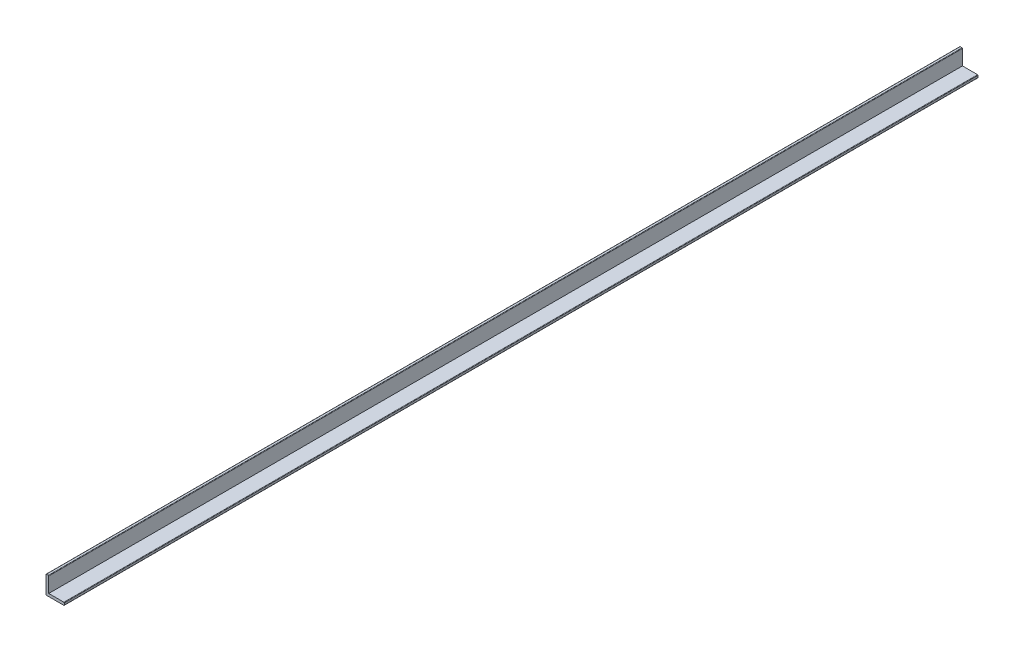
ISO-10303-21;
HEADER;
FILE_DESCRIPTION(('STEP AP214'),'2;1');
FILE_NAME('part.step','',(''),(''),'','','');
FILE_SCHEMA(('AUTOMOTIVE_DESIGN { 1 0 10303 214 1 1 1 1 }'));
ENDSEC;
DATA;
#1=APPLICATION_CONTEXT('core data for automotive mechanical design processes');
#2=APPLICATION_PROTOCOL_DEFINITION('international standard','automotive_design',2000,#1);
#3=PRODUCT_CONTEXT('',#1,'mechanical');
#4=PRODUCT('Part','Part','',(#3));
#5=PRODUCT_RELATED_PRODUCT_CATEGORY('part','',(#4));
#6=PRODUCT_DEFINITION_FORMATION('','',#4);
#7=PRODUCT_DEFINITION_CONTEXT('part definition',#1,'design');
#8=PRODUCT_DEFINITION('design','',#6,#7);
#9=PRODUCT_DEFINITION_SHAPE('','',#8);
#10=(LENGTH_UNIT() NAMED_UNIT(*) SI_UNIT(.MILLI.,.METRE.));
#11=(NAMED_UNIT(*) PLANE_ANGLE_UNIT() SI_UNIT($,.RADIAN.));
#12=(NAMED_UNIT(*) SI_UNIT($,.STERADIAN.) SOLID_ANGLE_UNIT());
#13=UNCERTAINTY_MEASURE_WITH_UNIT(LENGTH_MEASURE(1.E-05),#10,'distance_accuracy_value','');
#14=(GEOMETRIC_REPRESENTATION_CONTEXT(3) GLOBAL_UNCERTAINTY_ASSIGNED_CONTEXT((#13)) GLOBAL_UNIT_ASSIGNED_CONTEXT((#10,
#11,#12)) REPRESENTATION_CONTEXT('',''));
#15=CARTESIAN_POINT('',(0.,0.,0.));
#16=DIRECTION('',(0.,0.,1.));
#17=DIRECTION('',(1.,0.,0.));
#18=AXIS2_PLACEMENT_3D('',#15,#16,#17);
#19=CARTESIAN_POINT('',(0.,0.,1000.));
#20=DIRECTION('',(0.,1.,0.));
#21=DIRECTION('',(0.,0.,1.));
#22=AXIS2_PLACEMENT_3D('',#19,#20,#21);
#23=PLANE('',#22);
#24=DIRECTION('',(1.,0.,0.));
#25=VECTOR('',#24,1.);
#26=CARTESIAN_POINT('',(0.,0.,0.));
#27=LINE('',#26,#25);
#28=CARTESIAN_POINT('',(0.5,0.,0.));
#29=VERTEX_POINT('',#28);
#30=CARTESIAN_POINT('',(19.5,0.,0.));
#31=VERTEX_POINT('',#30);
#32=EDGE_CURVE('E136',#29,#31,#27,.T.);
#33=ORIENTED_EDGE('',*,*,#32,.T.);
#34=DIRECTION('',(0.,0.,-1.));
#35=VECTOR('',#34,1.);
#36=CARTESIAN_POINT('',(19.5,0.,1000.));
#37=LINE('',#36,#35);
#38=CARTESIAN_POINT('',(19.5,0.,1000.));
#39=VERTEX_POINT('',#38);
#40=EDGE_CURVE('E167',#31,#39,#37,.F.);
#41=ORIENTED_EDGE('',*,*,#40,.T.);
#42=DIRECTION('',(1.,0.,0.));
#43=VECTOR('',#42,1.);
#44=CARTESIAN_POINT('',(0.,0.,1000.));
#45=LINE('',#44,#43);
#46=CARTESIAN_POINT('',(0.5,0.,1000.));
#47=VERTEX_POINT('',#46);
#48=EDGE_CURVE('E129',#47,#39,#45,.T.);
#49=ORIENTED_EDGE('',*,*,#48,.F.);
#50=DIRECTION('',(0.,0.,-1.));
#51=VECTOR('',#50,1.);
#52=CARTESIAN_POINT('',(0.5,0.,1000.));
#53=LINE('',#52,#51);
#54=EDGE_CURVE('E164',#47,#29,#53,.T.);
#55=ORIENTED_EDGE('',*,*,#54,.T.);
#56=EDGE_LOOP('',(#33,#41,#49,#55));
#57=FACE_BOUND('',#56,.T.);
#58=ADVANCED_FACE('F15',(#57),#23,.F.);
#59=CARTESIAN_POINT('',(20.,3.,1000.));
#60=DIRECTION('',(1.,0.,0.));
#61=DIRECTION('',(0.,0.,-1.));
#62=AXIS2_PLACEMENT_3D('',#59,#60,#61);
#63=PLANE('',#62);
#64=DIRECTION('',(0.,-1.,0.));
#65=VECTOR('',#64,1.);
#66=CARTESIAN_POINT('',(20.,3.,1000.));
#67=LINE('',#66,#65);
#68=CARTESIAN_POINT('',(20.,2.5,1000.));
#69=VERTEX_POINT('',#68);
#70=CARTESIAN_POINT('',(20.,0.5,1000.));
#71=VERTEX_POINT('',#70);
#72=EDGE_CURVE('E126',#69,#71,#67,.T.);
#73=ORIENTED_EDGE('',*,*,#72,.T.);
#74=DIRECTION('',(0.,0.,-1.));
#75=VECTOR('',#74,1.);
#76=CARTESIAN_POINT('',(20.,0.5,0.));
#77=LINE('',#76,#75);
#78=CARTESIAN_POINT('',(20.,0.5,0.));
#79=VERTEX_POINT('',#78);
#80=EDGE_CURVE('E151',#71,#79,#77,.T.);
#81=ORIENTED_EDGE('',*,*,#80,.T.);
#82=DIRECTION('',(0.,-1.,0.));
#83=VECTOR('',#82,1.);
#84=CARTESIAN_POINT('',(20.,3.,0.));
#85=LINE('',#84,#83);
#86=CARTESIAN_POINT('',(20.,2.5,0.));
#87=VERTEX_POINT('',#86);
#88=EDGE_CURVE('E139',#87,#79,#85,.T.);
#89=ORIENTED_EDGE('',*,*,#88,.F.);
#90=DIRECTION('',(0.,0.,-1.));
#91=VECTOR('',#90,1.);
#92=CARTESIAN_POINT('',(20.,2.5,1000.));
#93=LINE('',#92,#91);
#94=EDGE_CURVE('E118',#87,#69,#93,.F.);
#95=ORIENTED_EDGE('',*,*,#94,.T.);
#96=EDGE_LOOP('',(#73,#81,#89,#95));
#97=FACE_BOUND('',#96,.T.);
#98=ADVANCED_FACE('F211',(#97),#63,.T.);
#99=CARTESIAN_POINT('',(0.,3.,1000.));
#100=DIRECTION('',(0.,1.,0.));
#101=DIRECTION('',(0.,0.,1.));
#102=AXIS2_PLACEMENT_3D('',#99,#100,#101);
#103=PLANE('',#102);
#104=DIRECTION('',(1.,0.,0.));
#105=VECTOR('',#104,1.);
#106=CARTESIAN_POINT('',(0.,3.,1000.));
#107=LINE('',#106,#105);
#108=CARTESIAN_POINT('',(3.,3.,1000.));
#109=VERTEX_POINT('',#108);
#110=CARTESIAN_POINT('',(19.5,3.,1000.));
#111=VERTEX_POINT('',#110);
#112=EDGE_CURVE('E109',#109,#111,#107,.T.);
#113=ORIENTED_EDGE('',*,*,#112,.T.);
#114=DIRECTION('',(0.,0.,-1.));
#115=VECTOR('',#114,1.);
#116=CARTESIAN_POINT('',(19.5,3.,1000.));
#117=LINE('',#116,#115);
#118=CARTESIAN_POINT('',(19.5,3.,0.));
#119=VERTEX_POINT('',#118);
#120=EDGE_CURVE('E177',#111,#119,#117,.T.);
#121=ORIENTED_EDGE('',*,*,#120,.T.);
#122=DIRECTION('',(1.,0.,0.));
#123=VECTOR('',#122,1.);
#124=CARTESIAN_POINT('',(0.,3.,0.));
#125=LINE('',#124,#123);
#126=CARTESIAN_POINT('',(3.,3.,0.));
#127=VERTEX_POINT('',#126);
#128=EDGE_CURVE('E117',#127,#119,#125,.T.);
#129=ORIENTED_EDGE('',*,*,#128,.F.);
#130=DIRECTION('',(0.,0.,-1.));
#131=VECTOR('',#130,1.);
#132=CARTESIAN_POINT('',(3.,3.,1000.));
#133=LINE('',#132,#131);
#134=EDGE_CURVE('E103',#109,#127,#133,.T.);
#135=ORIENTED_EDGE('',*,*,#134,.F.);
#136=EDGE_LOOP('',(#113,#121,#129,#135));
#137=FACE_BOUND('',#136,.T.);
#138=ADVANCED_FACE('F113',(#137),#103,.T.);
#139=CARTESIAN_POINT('',(3.,0.,1000.));
#140=DIRECTION('',(1.,0.,0.));
#141=DIRECTION('',(0.,0.,-1.));
#142=AXIS2_PLACEMENT_3D('',#139,#140,#141);
#143=PLANE('',#142);
#144=DIRECTION('',(0.,1.,0.));
#145=VECTOR('',#144,1.);
#146=CARTESIAN_POINT('',(3.,0.,0.));
#147=LINE('',#146,#145);
#148=CARTESIAN_POINT('',(3.,19.5,0.));
#149=VERTEX_POINT('',#148);
#150=EDGE_CURVE('E143',#149,#127,#147,.F.);
#151=ORIENTED_EDGE('',*,*,#150,.F.);
#152=DIRECTION('',(0.,0.,-1.));
#153=VECTOR('',#152,1.);
#154=CARTESIAN_POINT('',(3.,19.5,1000.));
#155=LINE('',#154,#153);
#156=CARTESIAN_POINT('',(3.,19.5,1000.));
#157=VERTEX_POINT('',#156);
#158=EDGE_CURVE('E9',#149,#157,#155,.F.);
#159=ORIENTED_EDGE('',*,*,#158,.T.);
#160=DIRECTION('',(0.,1.,0.));
#161=VECTOR('',#160,1.);
#162=CARTESIAN_POINT('',(3.,0.,1000.));
#163=LINE('',#162,#161);
#164=EDGE_CURVE('E99',#157,#109,#163,.F.);
#165=ORIENTED_EDGE('',*,*,#164,.T.);
#166=ORIENTED_EDGE('',*,*,#134,.T.);
#167=EDGE_LOOP('',(#151,#159,#165,#166));
#168=FACE_BOUND('',#167,.T.);
#169=ADVANCED_FACE('F102',(#168),#143,.T.);
#170=CARTESIAN_POINT('',(0.,20.,1000.));
#171=DIRECTION('',(0.,1.,0.));
#172=DIRECTION('',(0.,0.,1.));
#173=AXIS2_PLACEMENT_3D('',#170,#171,#172);
#174=PLANE('',#173);
#175=DIRECTION('',(1.,0.,0.));
#176=VECTOR('',#175,1.);
#177=CARTESIAN_POINT('',(0.,20.,1000.));
#178=LINE('',#177,#176);
#179=CARTESIAN_POINT('',(0.5,20.,1000.));
#180=VERTEX_POINT('',#179);
#181=CARTESIAN_POINT('',(2.5,20.,1000.));
#182=VERTEX_POINT('',#181);
#183=EDGE_CURVE('E108',#180,#182,#178,.T.);
#184=ORIENTED_EDGE('',*,*,#183,.T.);
#185=DIRECTION('',(0.,0.,-1.));
#186=VECTOR('',#185,1.);
#187=CARTESIAN_POINT('',(2.5,20.,1000.));
#188=LINE('',#187,#186);
#189=CARTESIAN_POINT('',(2.5,20.,0.));
#190=VERTEX_POINT('',#189);
#191=EDGE_CURVE('E23',#182,#190,#188,.T.);
#192=ORIENTED_EDGE('',*,*,#191,.T.);
#193=DIRECTION('',(1.,0.,0.));
#194=VECTOR('',#193,1.);
#195=CARTESIAN_POINT('',(0.,20.,0.));
#196=LINE('',#195,#194);
#197=CARTESIAN_POINT('',(0.5,20.,0.));
#198=VERTEX_POINT('',#197);
#199=EDGE_CURVE('E145',#198,#190,#196,.T.);
#200=ORIENTED_EDGE('',*,*,#199,.F.);
#201=DIRECTION('',(0.,0.,-1.));
#202=VECTOR('',#201,1.);
#203=CARTESIAN_POINT('',(0.5,20.,1000.));
#204=LINE('',#203,#202);
#205=EDGE_CURVE('E183',#198,#180,#204,.F.);
#206=ORIENTED_EDGE('',*,*,#205,.T.);
#207=EDGE_LOOP('',(#184,#192,#200,#206));
#208=FACE_BOUND('',#207,.T.);
#209=ADVANCED_FACE('F188',(#208),#174,.T.);
#210=CARTESIAN_POINT('',(0.,0.,1000.));
#211=DIRECTION('',(1.,0.,0.));
#212=DIRECTION('',(0.,0.,-1.));
#213=AXIS2_PLACEMENT_3D('',#210,#211,#212);
#214=PLANE('',#213);
#215=DIRECTION('',(0.,-1.,0.));
#216=VECTOR('',#215,1.);
#217=CARTESIAN_POINT('',(0.,0.,0.));
#218=LINE('',#217,#216);
#219=CARTESIAN_POINT('',(0.,19.5,0.));
#220=VERTEX_POINT('',#219);
#221=CARTESIAN_POINT('',(0.,0.5,0.));
#222=VERTEX_POINT('',#221);
#223=EDGE_CURVE('E148',#220,#222,#218,.T.);
#224=ORIENTED_EDGE('',*,*,#223,.T.);
#225=DIRECTION('',(0.,0.,-1.));
#226=VECTOR('',#225,1.);
#227=CARTESIAN_POINT('',(0.,0.5,1000.));
#228=LINE('',#227,#226);
#229=CARTESIAN_POINT('',(0.,0.5,1000.));
#230=VERTEX_POINT('',#229);
#231=EDGE_CURVE('E30',#222,#230,#228,.F.);
#232=ORIENTED_EDGE('',*,*,#231,.T.);
#233=DIRECTION('',(0.,-1.,0.));
#234=VECTOR('',#233,1.);
#235=CARTESIAN_POINT('',(0.,0.,1000.));
#236=LINE('',#235,#234);
#237=CARTESIAN_POINT('',(0.,19.5,1000.));
#238=VERTEX_POINT('',#237);
#239=EDGE_CURVE('E119',#238,#230,#236,.T.);
#240=ORIENTED_EDGE('',*,*,#239,.F.);
#241=DIRECTION('',(0.,0.,-1.));
#242=VECTOR('',#241,1.);
#243=CARTESIAN_POINT('',(0.,19.5,0.));
#244=LINE('',#243,#242);
#245=EDGE_CURVE('E179',#238,#220,#244,.T.);
#246=ORIENTED_EDGE('',*,*,#245,.T.);
#247=EDGE_LOOP('',(#224,#232,#240,#246));
#248=FACE_BOUND('',#247,.T.);
#249=ADVANCED_FACE('F196',(#248),#214,.F.);
#250=CARTESIAN_POINT('',(0.,0.,1000.));
#251=DIRECTION('',(0.,0.,-1.));
#252=DIRECTION('',(-1.,0.,0.));
#253=AXIS2_PLACEMENT_3D('',#250,#251,#252);
#254=PLANE('',#253);
#255=ORIENTED_EDGE('',*,*,#48,.T.);
#256=CARTESIAN_POINT('',(19.5,0.5,1000.));
#257=DIRECTION('',(0.,0.,-1.));
#258=DIRECTION('',(-1.,0.,0.));
#259=AXIS2_PLACEMENT_3D('',#256,#257,#258);
#260=CIRCLE('',#259,0.5);
#261=EDGE_CURVE('E175',#39,#71,#260,.F.);
#262=ORIENTED_EDGE('',*,*,#261,.T.);
#263=ORIENTED_EDGE('',*,*,#72,.F.);
#264=CARTESIAN_POINT('',(19.5,2.5,1000.));
#265=DIRECTION('',(0.,0.,-1.));
#266=DIRECTION('',(-1.,0.,0.));
#267=AXIS2_PLACEMENT_3D('',#264,#265,#266);
#268=CIRCLE('',#267,0.5);
#269=EDGE_CURVE('E125',#69,#111,#268,.F.);
#270=ORIENTED_EDGE('',*,*,#269,.T.);
#271=ORIENTED_EDGE('',*,*,#112,.F.);
#272=ORIENTED_EDGE('',*,*,#164,.F.);
#273=CARTESIAN_POINT('',(2.5,19.5,1000.));
#274=DIRECTION('',(0.,0.,-1.));
#275=DIRECTION('',(-1.,0.,0.));
#276=AXIS2_PLACEMENT_3D('',#273,#274,#275);
#277=CIRCLE('',#276,0.5);
#278=EDGE_CURVE('E170',#157,#182,#277,.F.);
#279=ORIENTED_EDGE('',*,*,#278,.T.);
#280=ORIENTED_EDGE('',*,*,#183,.F.);
#281=CARTESIAN_POINT('',(0.5,19.5,1000.));
#282=DIRECTION('',(0.,0.,-1.));
#283=DIRECTION('',(-1.,0.,0.));
#284=AXIS2_PLACEMENT_3D('',#281,#282,#283);
#285=CIRCLE('',#284,0.5);
#286=EDGE_CURVE('E37',#180,#238,#285,.F.);
#287=ORIENTED_EDGE('',*,*,#286,.T.);
#288=ORIENTED_EDGE('',*,*,#239,.T.);
#289=CARTESIAN_POINT('',(0.5,0.5,1000.));
#290=DIRECTION('',(0.,0.,-1.));
#291=DIRECTION('',(-1.,0.,0.));
#292=AXIS2_PLACEMENT_3D('',#289,#290,#291);
#293=CIRCLE('',#292,0.5);
#294=EDGE_CURVE('E172',#230,#47,#293,.F.);
#295=ORIENTED_EDGE('',*,*,#294,.T.);
#296=EDGE_LOOP('',(#255,#262,#263,#270,#271,#272,#279,#280,#287,#288,#295));
#297=FACE_BOUND('',#296,.T.);
#298=ADVANCED_FACE('F122',(#297),#254,.F.);
#299=CARTESIAN_POINT('',(0.,0.,0.));
#300=DIRECTION('',(0.,0.,-1.));
#301=DIRECTION('',(-1.,0.,0.));
#302=AXIS2_PLACEMENT_3D('',#299,#300,#301);
#303=PLANE('',#302);
#304=ORIENTED_EDGE('',*,*,#88,.T.);
#305=CARTESIAN_POINT('',(19.5,0.5,0.));
#306=DIRECTION('',(0.,0.,-1.));
#307=DIRECTION('',(-1.,0.,0.));
#308=AXIS2_PLACEMENT_3D('',#305,#306,#307);
#309=CIRCLE('',#308,0.5);
#310=EDGE_CURVE('E162',#79,#31,#309,.T.);
#311=ORIENTED_EDGE('',*,*,#310,.T.);
#312=ORIENTED_EDGE('',*,*,#32,.F.);
#313=CARTESIAN_POINT('',(0.5,0.5,0.));
#314=DIRECTION('',(0.,0.,-1.));
#315=DIRECTION('',(-1.,0.,0.));
#316=AXIS2_PLACEMENT_3D('',#313,#314,#315);
#317=CIRCLE('',#316,0.5);
#318=EDGE_CURVE('E158',#29,#222,#317,.T.);
#319=ORIENTED_EDGE('',*,*,#318,.T.);
#320=ORIENTED_EDGE('',*,*,#223,.F.);
#321=CARTESIAN_POINT('',(0.5,19.5,0.));
#322=DIRECTION('',(0.,0.,-1.));
#323=DIRECTION('',(-1.,0.,0.));
#324=AXIS2_PLACEMENT_3D('',#321,#322,#323);
#325=CIRCLE('',#324,0.5);
#326=EDGE_CURVE('E154',#220,#198,#325,.T.);
#327=ORIENTED_EDGE('',*,*,#326,.T.);
#328=ORIENTED_EDGE('',*,*,#199,.T.);
#329=CARTESIAN_POINT('',(2.5,19.5,0.));
#330=DIRECTION('',(0.,0.,-1.));
#331=DIRECTION('',(-1.,0.,0.));
#332=AXIS2_PLACEMENT_3D('',#329,#330,#331);
#333=CIRCLE('',#332,0.5);
#334=EDGE_CURVE('E156',#190,#149,#333,.T.);
#335=ORIENTED_EDGE('',*,*,#334,.T.);
#336=ORIENTED_EDGE('',*,*,#150,.T.);
#337=ORIENTED_EDGE('',*,*,#128,.T.);
#338=CARTESIAN_POINT('',(19.5,2.5,0.));
#339=DIRECTION('',(0.,0.,-1.));
#340=DIRECTION('',(-1.,0.,0.));
#341=AXIS2_PLACEMENT_3D('',#338,#339,#340);
#342=CIRCLE('',#341,0.5);
#343=EDGE_CURVE('E160',#119,#87,#342,.T.);
#344=ORIENTED_EDGE('',*,*,#343,.T.);
#345=EDGE_LOOP('',(#304,#311,#312,#319,#320,#327,#328,#335,#336,#337,#344));
#346=FACE_BOUND('',#345,.T.);
#347=ADVANCED_FACE('F192',(#346),#303,.T.);
#348=CARTESIAN_POINT('',(19.5,0.5,1000.));
#349=DIRECTION('',(0.,0.,1.));
#350=DIRECTION('',(1.,0.,0.));
#351=AXIS2_PLACEMENT_3D('',#348,#349,#350);
#352=CYLINDRICAL_SURFACE('',#351,0.5);
#353=ORIENTED_EDGE('',*,*,#261,.F.);
#354=ORIENTED_EDGE('',*,*,#40,.F.);
#355=ORIENTED_EDGE('',*,*,#310,.F.);
#356=ORIENTED_EDGE('',*,*,#80,.F.);
#357=EDGE_LOOP('',(#353,#354,#355,#356));
#358=FACE_BOUND('',#357,.T.);
#359=ADVANCED_FACE('F209',(#358),#352,.T.);
#360=CARTESIAN_POINT('',(19.5,2.5,1000.));
#361=DIRECTION('',(0.,0.,-1.));
#362=DIRECTION('',(-1.,0.,0.));
#363=AXIS2_PLACEMENT_3D('',#360,#361,#362);
#364=CYLINDRICAL_SURFACE('',#363,0.5);
#365=ORIENTED_EDGE('',*,*,#269,.F.);
#366=ORIENTED_EDGE('',*,*,#94,.F.);
#367=ORIENTED_EDGE('',*,*,#343,.F.);
#368=ORIENTED_EDGE('',*,*,#120,.F.);
#369=EDGE_LOOP('',(#365,#366,#367,#368));
#370=FACE_BOUND('',#369,.T.);
#371=ADVANCED_FACE('F214',(#370),#364,.T.);
#372=CARTESIAN_POINT('',(0.5,0.5,1000.));
#373=DIRECTION('',(0.,0.,-1.));
#374=DIRECTION('',(-1.,0.,0.));
#375=AXIS2_PLACEMENT_3D('',#372,#373,#374);
#376=CYLINDRICAL_SURFACE('',#375,0.5);
#377=ORIENTED_EDGE('',*,*,#294,.F.);
#378=ORIENTED_EDGE('',*,*,#231,.F.);
#379=ORIENTED_EDGE('',*,*,#318,.F.);
#380=ORIENTED_EDGE('',*,*,#54,.F.);
#381=EDGE_LOOP('',(#377,#378,#379,#380));
#382=FACE_BOUND('',#381,.T.);
#383=ADVANCED_FACE('F201',(#382),#376,.T.);
#384=CARTESIAN_POINT('',(2.5,19.5,1000.));
#385=DIRECTION('',(0.,0.,-1.));
#386=DIRECTION('',(-1.,0.,0.));
#387=AXIS2_PLACEMENT_3D('',#384,#385,#386);
#388=CYLINDRICAL_SURFACE('',#387,0.5);
#389=ORIENTED_EDGE('',*,*,#278,.F.);
#390=ORIENTED_EDGE('',*,*,#158,.F.);
#391=ORIENTED_EDGE('',*,*,#334,.F.);
#392=ORIENTED_EDGE('',*,*,#191,.F.);
#393=EDGE_LOOP('',(#389,#390,#391,#392));
#394=FACE_BOUND('',#393,.T.);
#395=ADVANCED_FACE('F215',(#394),#388,.T.);
#396=CARTESIAN_POINT('',(0.5,19.5,1000.));
#397=DIRECTION('',(0.,0.,1.));
#398=DIRECTION('',(1.,0.,0.));
#399=AXIS2_PLACEMENT_3D('',#396,#397,#398);
#400=CYLINDRICAL_SURFACE('',#399,0.5);
#401=ORIENTED_EDGE('',*,*,#286,.F.);
#402=ORIENTED_EDGE('',*,*,#205,.F.);
#403=ORIENTED_EDGE('',*,*,#326,.F.);
#404=ORIENTED_EDGE('',*,*,#245,.F.);
#405=EDGE_LOOP('',(#401,#402,#403,#404));
#406=FACE_BOUND('',#405,.T.);
#407=ADVANCED_FACE('F17',(#406),#400,.T.);
#408=CLOSED_SHELL('',(#58,#98,#138,#169,#209,#249,#298,#347,#359,#371,#383,#395,#407));
#409=MANIFOLD_SOLID_BREP('B1',#408);
#410=ADVANCED_BREP_SHAPE_REPRESENTATION('',(#18,#409),#14);
#411=SHAPE_DEFINITION_REPRESENTATION(#9,#410);
ENDSEC;
END-ISO-10303-21;
